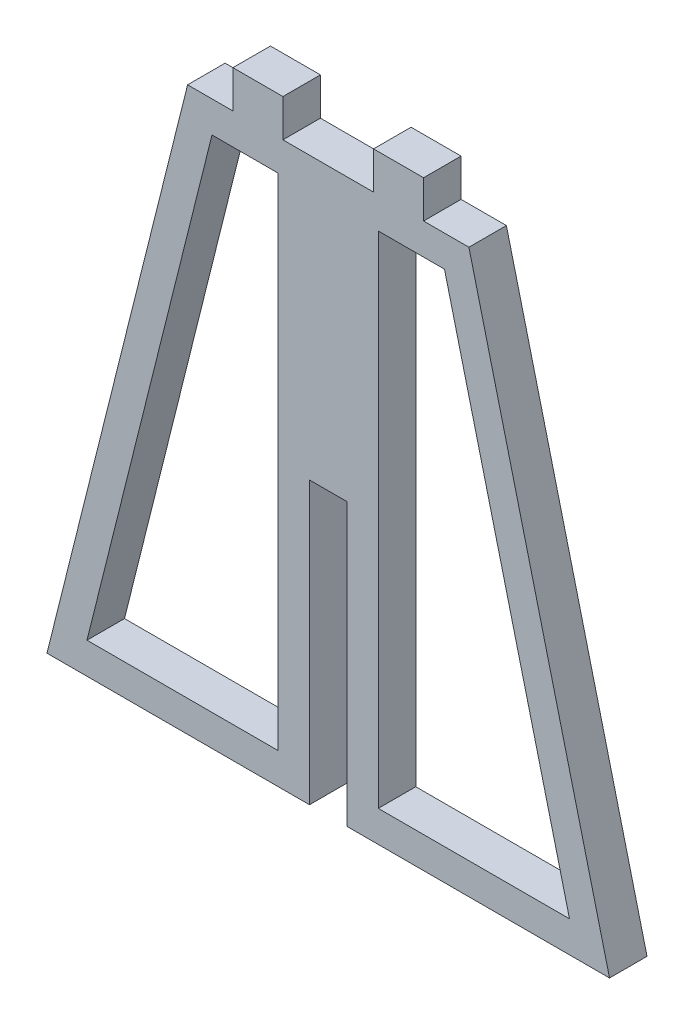
ISO-10303-21;
HEADER;
FILE_DESCRIPTION(('STEP AP214'),'2;1');
FILE_NAME('part.step','',(''),(''),'','','');
FILE_SCHEMA(('AUTOMOTIVE_DESIGN { 1 0 10303 214 1 1 1 1 }'));
ENDSEC;
DATA;
#1=APPLICATION_CONTEXT('core data for automotive mechanical design processes');
#2=APPLICATION_PROTOCOL_DEFINITION('international standard','automotive_design',2000,#1);
#3=PRODUCT_CONTEXT('',#1,'mechanical');
#4=PRODUCT('Part','Part','',(#3));
#5=PRODUCT_RELATED_PRODUCT_CATEGORY('part','',(#4));
#6=PRODUCT_DEFINITION_FORMATION('','',#4);
#7=PRODUCT_DEFINITION_CONTEXT('part definition',#1,'design');
#8=PRODUCT_DEFINITION('design','',#6,#7);
#9=PRODUCT_DEFINITION_SHAPE('','',#8);
#10=(LENGTH_UNIT() NAMED_UNIT(*) SI_UNIT(.MILLI.,.METRE.));
#11=(NAMED_UNIT(*) PLANE_ANGLE_UNIT() SI_UNIT($,.RADIAN.));
#12=(NAMED_UNIT(*) SI_UNIT($,.STERADIAN.) SOLID_ANGLE_UNIT());
#13=UNCERTAINTY_MEASURE_WITH_UNIT(LENGTH_MEASURE(1.E-05),#10,'distance_accuracy_value','');
#14=(GEOMETRIC_REPRESENTATION_CONTEXT(3) GLOBAL_UNCERTAINTY_ASSIGNED_CONTEXT((#13)) GLOBAL_UNIT_ASSIGNED_CONTEXT((#10,
#11,#12)) REPRESENTATION_CONTEXT('',''));
#15=CARTESIAN_POINT('',(0.,0.,0.));
#16=DIRECTION('',(0.,0.,1.));
#17=DIRECTION('',(1.,0.,0.));
#18=AXIS2_PLACEMENT_3D('',#15,#16,#17);
#19=CARTESIAN_POINT('',(0.,0.,6.));
#20=DIRECTION('',(0.,0.,-1.));
#21=DIRECTION('',(-1.,0.,0.));
#22=AXIS2_PLACEMENT_3D('',#19,#20,#21);
#23=PLANE('',#22);
#24=DIRECTION('',(0.,1.,0.));
#25=VECTOR('',#24,1.);
#26=CARTESIAN_POINT('',(-8.,14.8653846153846,6.));
#27=LINE('',#26,#25);
#28=CARTESIAN_POINT('',(-8.,14.8653846153846,6.));
#29=VERTEX_POINT('',#28);
#30=CARTESIAN_POINT('',(-8.,94.8653846153846,6.));
#31=VERTEX_POINT('',#30);
#32=EDGE_CURVE('E231',#29,#31,#27,.T.);
#33=ORIENTED_EDGE('',*,*,#32,.F.);
#34=DIRECTION('',(1.,0.,0.));
#35=VECTOR('',#34,1.);
#36=CARTESIAN_POINT('',(-38.5961179679779,14.8653846153846,6.));
#37=LINE('',#36,#35);
#38=CARTESIAN_POINT('',(-38.5961179679779,14.8653846153846,6.));
#39=VERTEX_POINT('',#38);
#40=EDGE_CURVE('E239',#39,#29,#37,.T.);
#41=ORIENTED_EDGE('',*,*,#40,.F.);
#42=DIRECTION('',(-0.242535625036333,-0.970142500145332,0.));
#43=VECTOR('',#42,1.);
#44=CARTESIAN_POINT('',(-18.5961179679779,94.8653846153846,6.));
#45=LINE('',#44,#43);
#46=CARTESIAN_POINT('',(-18.5961179679779,94.8653846153846,6.));
#47=VERTEX_POINT('',#46);
#48=EDGE_CURVE('E236',#47,#39,#45,.T.);
#49=ORIENTED_EDGE('',*,*,#48,.F.);
#50=DIRECTION('',(-1.,0.,0.));
#51=VECTOR('',#50,1.);
#52=CARTESIAN_POINT('',(-8.,94.8653846153846,6.));
#53=LINE('',#52,#51);
#54=EDGE_CURVE('E233',#31,#47,#53,.T.);
#55=ORIENTED_EDGE('',*,*,#54,.F.);
#56=EDGE_LOOP('',(#33,#41,#49,#55));
#57=FACE_BOUND('',#56,.T.);
#58=DIRECTION('',(-0.242535625036333,0.970142500145332,0.));
#59=VECTOR('',#58,1.);
#60=CARTESIAN_POINT('',(22.5,99.8653846153846,6.));
#61=LINE('',#60,#59);
#62=CARTESIAN_POINT('',(45.,9.86538461538461,6.));
#63=VERTEX_POINT('',#62);
#64=CARTESIAN_POINT('',(22.5,99.8653846153846,6.));
#65=VERTEX_POINT('',#64);
#66=EDGE_CURVE('E262',#63,#65,#61,.T.);
#67=ORIENTED_EDGE('',*,*,#66,.T.);
#68=DIRECTION('',(-1.,0.,0.));
#69=VECTOR('',#68,1.);
#70=CARTESIAN_POINT('',(15.25,99.8653846153846,6.));
#71=LINE('',#70,#69);
#72=CARTESIAN_POINT('',(15.25,99.8653846153846,6.));
#73=VERTEX_POINT('',#72);
#74=EDGE_CURVE('E265',#65,#73,#71,.T.);
#75=ORIENTED_EDGE('',*,*,#74,.T.);
#76=DIRECTION('',(0.,1.,0.));
#77=VECTOR('',#76,1.);
#78=CARTESIAN_POINT('',(15.25,99.8653846153846,6.));
#79=LINE('',#78,#77);
#80=CARTESIAN_POINT('',(15.25,105.865384615385,6.));
#81=VERTEX_POINT('',#80);
#82=EDGE_CURVE('E268',#73,#81,#79,.T.);
#83=ORIENTED_EDGE('',*,*,#82,.T.);
#84=DIRECTION('',(-1.,0.,0.));
#85=VECTOR('',#84,1.);
#86=CARTESIAN_POINT('',(7.25,105.865384615385,6.));
#87=LINE('',#86,#85);
#88=CARTESIAN_POINT('',(7.25,105.865384615385,6.));
#89=VERTEX_POINT('',#88);
#90=EDGE_CURVE('E270',#81,#89,#87,.T.);
#91=ORIENTED_EDGE('',*,*,#90,.T.);
#92=DIRECTION('',(0.,-1.,0.));
#93=VECTOR('',#92,1.);
#94=CARTESIAN_POINT('',(7.25,99.8653846153846,6.));
#95=LINE('',#94,#93);
#96=CARTESIAN_POINT('',(7.25,99.8653846153846,6.));
#97=VERTEX_POINT('',#96);
#98=EDGE_CURVE('E272',#89,#97,#95,.T.);
#99=ORIENTED_EDGE('',*,*,#98,.T.);
#100=DIRECTION('',(-1.,0.,0.));
#101=VECTOR('',#100,1.);
#102=CARTESIAN_POINT('',(-7.25,99.8653846153846,6.));
#103=LINE('',#102,#101);
#104=CARTESIAN_POINT('',(-7.25,99.8653846153846,6.));
#105=VERTEX_POINT('',#104);
#106=EDGE_CURVE('E274',#97,#105,#103,.T.);
#107=ORIENTED_EDGE('',*,*,#106,.T.);
#108=DIRECTION('',(0.,1.,0.));
#109=VECTOR('',#108,1.);
#110=CARTESIAN_POINT('',(-7.25,99.8653846153846,6.));
#111=LINE('',#110,#109);
#112=CARTESIAN_POINT('',(-7.25,105.865384615385,6.));
#113=VERTEX_POINT('',#112);
#114=EDGE_CURVE('E276',#105,#113,#111,.T.);
#115=ORIENTED_EDGE('',*,*,#114,.T.);
#116=DIRECTION('',(-1.,0.,0.));
#117=VECTOR('',#116,1.);
#118=CARTESIAN_POINT('',(-7.25,105.865384615385,6.));
#119=LINE('',#118,#117);
#120=CARTESIAN_POINT('',(-15.25,105.865384615385,6.));
#121=VERTEX_POINT('',#120);
#122=EDGE_CURVE('E278',#113,#121,#119,.T.);
#123=ORIENTED_EDGE('',*,*,#122,.T.);
#124=DIRECTION('',(0.,-1.,0.));
#125=VECTOR('',#124,1.);
#126=CARTESIAN_POINT('',(-15.25,99.8653846153846,6.));
#127=LINE('',#126,#125);
#128=CARTESIAN_POINT('',(-15.25,99.8653846153846,6.));
#129=VERTEX_POINT('',#128);
#130=EDGE_CURVE('E280',#121,#129,#127,.T.);
#131=ORIENTED_EDGE('',*,*,#130,.T.);
#132=DIRECTION('',(-1.,0.,0.));
#133=VECTOR('',#132,1.);
#134=CARTESIAN_POINT('',(-22.5,99.8653846153846,6.));
#135=LINE('',#134,#133);
#136=CARTESIAN_POINT('',(-22.5,99.8653846153846,6.));
#137=VERTEX_POINT('',#136);
#138=EDGE_CURVE('E282',#129,#137,#135,.T.);
#139=ORIENTED_EDGE('',*,*,#138,.T.);
#140=DIRECTION('',(-0.242535625036333,-0.970142500145332,0.));
#141=VECTOR('',#140,1.);
#142=CARTESIAN_POINT('',(-45.,9.8653846153846,6.));
#143=LINE('',#142,#141);
#144=CARTESIAN_POINT('',(-45.,9.8653846153846,6.));
#145=VERTEX_POINT('',#144);
#146=EDGE_CURVE('E284',#137,#145,#143,.T.);
#147=ORIENTED_EDGE('',*,*,#146,.T.);
#148=DIRECTION('',(1.,0.,0.));
#149=VECTOR('',#148,1.);
#150=CARTESIAN_POINT('',(-3.,9.86538461538459,6.));
#151=LINE('',#150,#149);
#152=CARTESIAN_POINT('',(-3.,9.86538461538459,6.));
#153=VERTEX_POINT('',#152);
#154=EDGE_CURVE('E286',#145,#153,#151,.T.);
#155=ORIENTED_EDGE('',*,*,#154,.T.);
#156=DIRECTION('',(0.,1.,0.));
#157=VECTOR('',#156,1.);
#158=CARTESIAN_POINT('',(-3.,54.8653846153846,6.));
#159=LINE('',#158,#157);
#160=CARTESIAN_POINT('',(-3.,54.8653846153846,6.));
#161=VERTEX_POINT('',#160);
#162=EDGE_CURVE('E288',#153,#161,#159,.T.);
#163=ORIENTED_EDGE('',*,*,#162,.T.);
#164=DIRECTION('',(1.,0.,0.));
#165=VECTOR('',#164,1.);
#166=CARTESIAN_POINT('',(3.,54.8653846153846,6.));
#167=LINE('',#166,#165);
#168=CARTESIAN_POINT('',(3.,54.8653846153846,6.));
#169=VERTEX_POINT('',#168);
#170=EDGE_CURVE('E290',#161,#169,#167,.T.);
#171=ORIENTED_EDGE('',*,*,#170,.T.);
#172=DIRECTION('',(0.,-1.,0.));
#173=VECTOR('',#172,1.);
#174=CARTESIAN_POINT('',(3.,54.8653846153846,6.));
#175=LINE('',#174,#173);
#176=CARTESIAN_POINT('',(3.,9.86538461538459,6.));
#177=VERTEX_POINT('',#176);
#178=EDGE_CURVE('E292',#169,#177,#175,.T.);
#179=ORIENTED_EDGE('',*,*,#178,.T.);
#180=DIRECTION('',(1.,0.,0.));
#181=VECTOR('',#180,1.);
#182=CARTESIAN_POINT('',(45.,9.86538461538461,6.));
#183=LINE('',#182,#181);
#184=EDGE_CURVE('E294',#177,#63,#183,.T.);
#185=ORIENTED_EDGE('',*,*,#184,.T.);
#186=EDGE_LOOP('',(#67,#75,#83,#91,#99,#107,#115,#123,#131,#139,#147,#155,#163,#171,#179,#185));
#187=FACE_BOUND('',#186,.T.);
#188=DIRECTION('',(-0.242535625036333,0.970142500145332,0.));
#189=VECTOR('',#188,1.);
#190=CARTESIAN_POINT('',(18.5961179679779,94.8653846153845,6.));
#191=LINE('',#190,#189);
#192=CARTESIAN_POINT('',(38.5961179679779,14.8653846153846,6.));
#193=VERTEX_POINT('',#192);
#194=CARTESIAN_POINT('',(18.5961179679779,94.8653846153845,6.));
#195=VERTEX_POINT('',#194);
#196=EDGE_CURVE('E195',#193,#195,#191,.T.);
#197=ORIENTED_EDGE('',*,*,#196,.F.);
#198=DIRECTION('',(1.,0.,0.));
#199=VECTOR('',#198,1.);
#200=CARTESIAN_POINT('',(38.5961179679779,14.8653846153846,6.));
#201=LINE('',#200,#199);
#202=CARTESIAN_POINT('',(8.,14.8653846153846,6.));
#203=VERTEX_POINT('',#202);
#204=EDGE_CURVE('E217',#203,#193,#201,.T.);
#205=ORIENTED_EDGE('',*,*,#204,.F.);
#206=DIRECTION('',(0.,-1.,0.));
#207=VECTOR('',#206,1.);
#208=CARTESIAN_POINT('',(8.,14.8653846153846,6.));
#209=LINE('',#208,#207);
#210=CARTESIAN_POINT('',(8.,94.8653846153845,6.));
#211=VERTEX_POINT('',#210);
#212=EDGE_CURVE('E215',#211,#203,#209,.T.);
#213=ORIENTED_EDGE('',*,*,#212,.F.);
#214=DIRECTION('',(-1.,0.,0.));
#215=VECTOR('',#214,1.);
#216=CARTESIAN_POINT('',(8.,94.8653846153845,6.));
#217=LINE('',#216,#215);
#218=EDGE_CURVE('E203',#195,#211,#217,.T.);
#219=ORIENTED_EDGE('',*,*,#218,.F.);
#220=EDGE_LOOP('',(#197,#205,#213,#219));
#221=FACE_BOUND('',#220,.T.);
#222=ADVANCED_FACE('F34',(#57,#187,#221),#23,.F.);
#223=CARTESIAN_POINT('',(0.,0.,0.));
#224=DIRECTION('',(0.,0.,-1.));
#225=DIRECTION('',(-1.,0.,0.));
#226=AXIS2_PLACEMENT_3D('',#223,#224,#225);
#227=PLANE('',#226);
#228=DIRECTION('',(-0.242535625036333,0.970142500145332,0.));
#229=VECTOR('',#228,1.);
#230=CARTESIAN_POINT('',(22.5,99.8653846153846,0.));
#231=LINE('',#230,#229);
#232=CARTESIAN_POINT('',(45.,9.86538461538461,0.));
#233=VERTEX_POINT('',#232);
#234=CARTESIAN_POINT('',(22.5,99.8653846153846,0.));
#235=VERTEX_POINT('',#234);
#236=EDGE_CURVE('E261',#233,#235,#231,.T.);
#237=ORIENTED_EDGE('',*,*,#236,.F.);
#238=DIRECTION('',(1.,0.,0.));
#239=VECTOR('',#238,1.);
#240=CARTESIAN_POINT('',(45.,9.86538461538461,0.));
#241=LINE('',#240,#239);
#242=CARTESIAN_POINT('',(3.,9.86538461538459,0.));
#243=VERTEX_POINT('',#242);
#244=EDGE_CURVE('E266',#243,#233,#241,.T.);
#245=ORIENTED_EDGE('',*,*,#244,.F.);
#246=DIRECTION('',(0.,-1.,0.));
#247=VECTOR('',#246,1.);
#248=CARTESIAN_POINT('',(3.,54.8653846153846,0.));
#249=LINE('',#248,#247);
#250=CARTESIAN_POINT('',(3.,54.8653846153846,0.));
#251=VERTEX_POINT('',#250);
#252=EDGE_CURVE('E325',#251,#243,#249,.T.);
#253=ORIENTED_EDGE('',*,*,#252,.F.);
#254=DIRECTION('',(1.,0.,0.));
#255=VECTOR('',#254,1.);
#256=CARTESIAN_POINT('',(3.,54.8653846153846,0.));
#257=LINE('',#256,#255);
#258=CARTESIAN_POINT('',(-3.,54.8653846153846,0.));
#259=VERTEX_POINT('',#258);
#260=EDGE_CURVE('E323',#259,#251,#257,.T.);
#261=ORIENTED_EDGE('',*,*,#260,.F.);
#262=DIRECTION('',(0.,1.,0.));
#263=VECTOR('',#262,1.);
#264=CARTESIAN_POINT('',(-3.,54.8653846153846,0.));
#265=LINE('',#264,#263);
#266=CARTESIAN_POINT('',(-3.,9.86538461538459,0.));
#267=VERTEX_POINT('',#266);
#268=EDGE_CURVE('E321',#267,#259,#265,.T.);
#269=ORIENTED_EDGE('',*,*,#268,.F.);
#270=DIRECTION('',(1.,0.,0.));
#271=VECTOR('',#270,1.);
#272=CARTESIAN_POINT('',(-3.,9.86538461538459,0.));
#273=LINE('',#272,#271);
#274=CARTESIAN_POINT('',(-45.,9.8653846153846,0.));
#275=VERTEX_POINT('',#274);
#276=EDGE_CURVE('E319',#275,#267,#273,.T.);
#277=ORIENTED_EDGE('',*,*,#276,.F.);
#278=DIRECTION('',(-0.242535625036333,-0.970142500145332,0.));
#279=VECTOR('',#278,1.);
#280=CARTESIAN_POINT('',(-45.,9.8653846153846,0.));
#281=LINE('',#280,#279);
#282=CARTESIAN_POINT('',(-22.5,99.8653846153846,0.));
#283=VERTEX_POINT('',#282);
#284=EDGE_CURVE('E317',#283,#275,#281,.T.);
#285=ORIENTED_EDGE('',*,*,#284,.F.);
#286=DIRECTION('',(-1.,0.,0.));
#287=VECTOR('',#286,1.);
#288=CARTESIAN_POINT('',(-22.5,99.8653846153846,0.));
#289=LINE('',#288,#287);
#290=CARTESIAN_POINT('',(-15.25,99.8653846153846,0.));
#291=VERTEX_POINT('',#290);
#292=EDGE_CURVE('E315',#291,#283,#289,.T.);
#293=ORIENTED_EDGE('',*,*,#292,.F.);
#294=DIRECTION('',(0.,-1.,0.));
#295=VECTOR('',#294,1.);
#296=CARTESIAN_POINT('',(-15.25,99.8653846153846,0.));
#297=LINE('',#296,#295);
#298=CARTESIAN_POINT('',(-15.25,105.865384615385,0.));
#299=VERTEX_POINT('',#298);
#300=EDGE_CURVE('E313',#299,#291,#297,.T.);
#301=ORIENTED_EDGE('',*,*,#300,.F.);
#302=DIRECTION('',(-1.,0.,0.));
#303=VECTOR('',#302,1.);
#304=CARTESIAN_POINT('',(-7.25,105.865384615385,0.));
#305=LINE('',#304,#303);
#306=CARTESIAN_POINT('',(-7.25,105.865384615385,0.));
#307=VERTEX_POINT('',#306);
#308=EDGE_CURVE('E311',#307,#299,#305,.T.);
#309=ORIENTED_EDGE('',*,*,#308,.F.);
#310=DIRECTION('',(0.,1.,0.));
#311=VECTOR('',#310,1.);
#312=CARTESIAN_POINT('',(-7.25,99.8653846153846,0.));
#313=LINE('',#312,#311);
#314=CARTESIAN_POINT('',(-7.25,99.8653846153846,0.));
#315=VERTEX_POINT('',#314);
#316=EDGE_CURVE('E309',#315,#307,#313,.T.);
#317=ORIENTED_EDGE('',*,*,#316,.F.);
#318=DIRECTION('',(-1.,0.,0.));
#319=VECTOR('',#318,1.);
#320=CARTESIAN_POINT('',(-7.25,99.8653846153846,0.));
#321=LINE('',#320,#319);
#322=CARTESIAN_POINT('',(7.25,99.8653846153846,0.));
#323=VERTEX_POINT('',#322);
#324=EDGE_CURVE('E307',#323,#315,#321,.T.);
#325=ORIENTED_EDGE('',*,*,#324,.F.);
#326=DIRECTION('',(0.,-1.,0.));
#327=VECTOR('',#326,1.);
#328=CARTESIAN_POINT('',(7.25,99.8653846153846,0.));
#329=LINE('',#328,#327);
#330=CARTESIAN_POINT('',(7.25,105.865384615385,0.));
#331=VERTEX_POINT('',#330);
#332=EDGE_CURVE('E305',#331,#323,#329,.T.);
#333=ORIENTED_EDGE('',*,*,#332,.F.);
#334=DIRECTION('',(-1.,0.,0.));
#335=VECTOR('',#334,1.);
#336=CARTESIAN_POINT('',(7.25,105.865384615385,0.));
#337=LINE('',#336,#335);
#338=CARTESIAN_POINT('',(15.25,105.865384615385,0.));
#339=VERTEX_POINT('',#338);
#340=EDGE_CURVE('E303',#339,#331,#337,.T.);
#341=ORIENTED_EDGE('',*,*,#340,.F.);
#342=DIRECTION('',(0.,1.,0.));
#343=VECTOR('',#342,1.);
#344=CARTESIAN_POINT('',(15.25,99.8653846153846,0.));
#345=LINE('',#344,#343);
#346=CARTESIAN_POINT('',(15.25,99.8653846153846,0.));
#347=VERTEX_POINT('',#346);
#348=EDGE_CURVE('E301',#347,#339,#345,.T.);
#349=ORIENTED_EDGE('',*,*,#348,.F.);
#350=DIRECTION('',(-1.,0.,0.));
#351=VECTOR('',#350,1.);
#352=CARTESIAN_POINT('',(15.25,99.8653846153846,0.));
#353=LINE('',#352,#351);
#354=EDGE_CURVE('E299',#235,#347,#353,.T.);
#355=ORIENTED_EDGE('',*,*,#354,.F.);
#356=EDGE_LOOP('',(#237,#245,#253,#261,#269,#277,#285,#293,#301,#309,#317,#325,#333,#341,#349,#355));
#357=FACE_BOUND('',#356,.T.);
#358=DIRECTION('',(1.,0.,0.));
#359=VECTOR('',#358,1.);
#360=CARTESIAN_POINT('',(-38.5961179679779,14.8653846153846,0.));
#361=LINE('',#360,#359);
#362=CARTESIAN_POINT('',(-38.5961179679779,14.8653846153846,0.));
#363=VERTEX_POINT('',#362);
#364=CARTESIAN_POINT('',(-8.,14.8653846153846,0.));
#365=VERTEX_POINT('',#364);
#366=EDGE_CURVE('E234',#363,#365,#361,.T.);
#367=ORIENTED_EDGE('',*,*,#366,.T.);
#368=DIRECTION('',(0.,1.,0.));
#369=VECTOR('',#368,1.);
#370=CARTESIAN_POINT('',(-8.,14.8653846153846,0.));
#371=LINE('',#370,#369);
#372=CARTESIAN_POINT('',(-8.,94.8653846153846,0.));
#373=VERTEX_POINT('',#372);
#374=EDGE_CURVE('E211',#365,#373,#371,.T.);
#375=ORIENTED_EDGE('',*,*,#374,.T.);
#376=DIRECTION('',(-1.,0.,0.));
#377=VECTOR('',#376,1.);
#378=CARTESIAN_POINT('',(-8.,94.8653846153846,0.));
#379=LINE('',#378,#377);
#380=CARTESIAN_POINT('',(-18.5961179679779,94.8653846153846,0.));
#381=VERTEX_POINT('',#380);
#382=EDGE_CURVE('E244',#373,#381,#379,.T.);
#383=ORIENTED_EDGE('',*,*,#382,.T.);
#384=DIRECTION('',(-0.242535625036333,-0.970142500145332,0.));
#385=VECTOR('',#384,1.);
#386=CARTESIAN_POINT('',(-18.5961179679779,94.8653846153846,0.));
#387=LINE('',#386,#385);
#388=EDGE_CURVE('E247',#381,#363,#387,.T.);
#389=ORIENTED_EDGE('',*,*,#388,.T.);
#390=EDGE_LOOP('',(#367,#375,#383,#389));
#391=FACE_BOUND('',#390,.T.);
#392=DIRECTION('',(1.,0.,0.));
#393=VECTOR('',#392,1.);
#394=CARTESIAN_POINT('',(38.5961179679779,14.8653846153846,0.));
#395=LINE('',#394,#393);
#396=CARTESIAN_POINT('',(8.,14.8653846153846,0.));
#397=VERTEX_POINT('',#396);
#398=CARTESIAN_POINT('',(38.5961179679779,14.8653846153846,0.));
#399=VERTEX_POINT('',#398);
#400=EDGE_CURVE('E204',#397,#399,#395,.T.);
#401=ORIENTED_EDGE('',*,*,#400,.T.);
#402=DIRECTION('',(-0.242535625036333,0.970142500145332,0.));
#403=VECTOR('',#402,1.);
#404=CARTESIAN_POINT('',(18.5961179679779,94.8653846153845,0.));
#405=LINE('',#404,#403);
#406=CARTESIAN_POINT('',(18.5961179679779,94.8653846153845,0.));
#407=VERTEX_POINT('',#406);
#408=EDGE_CURVE('E57',#399,#407,#405,.T.);
#409=ORIENTED_EDGE('',*,*,#408,.T.);
#410=DIRECTION('',(-1.,0.,0.));
#411=VECTOR('',#410,1.);
#412=CARTESIAN_POINT('',(8.,94.8653846153845,0.));
#413=LINE('',#412,#411);
#414=CARTESIAN_POINT('',(8.,94.8653846153845,0.));
#415=VERTEX_POINT('',#414);
#416=EDGE_CURVE('E210',#407,#415,#413,.T.);
#417=ORIENTED_EDGE('',*,*,#416,.T.);
#418=DIRECTION('',(0.,-1.,0.));
#419=VECTOR('',#418,1.);
#420=CARTESIAN_POINT('',(8.,14.8653846153846,0.));
#421=LINE('',#420,#419);
#422=EDGE_CURVE('E223',#415,#397,#421,.T.);
#423=ORIENTED_EDGE('',*,*,#422,.T.);
#424=EDGE_LOOP('',(#401,#409,#417,#423));
#425=FACE_BOUND('',#424,.T.);
#426=ADVANCED_FACE('F379',(#357,#391,#425),#227,.T.);
#427=CARTESIAN_POINT('',(22.5,99.8653846153846,6.));
#428=DIRECTION('',(-0.970142500145332,-0.242535625036333,0.));
#429=DIRECTION('',(0.242535625036333,-0.970142500145332,0.));
#430=AXIS2_PLACEMENT_3D('',#427,#428,#429);
#431=PLANE('',#430);
#432=ORIENTED_EDGE('',*,*,#236,.T.);
#433=DIRECTION('',(0.,0.,-1.));
#434=VECTOR('',#433,1.);
#435=CARTESIAN_POINT('',(22.5,99.8653846153846,6.));
#436=LINE('',#435,#434);
#437=EDGE_CURVE('E11',#65,#235,#436,.T.);
#438=ORIENTED_EDGE('',*,*,#437,.F.);
#439=ORIENTED_EDGE('',*,*,#66,.F.);
#440=DIRECTION('',(0.,0.,-1.));
#441=VECTOR('',#440,1.);
#442=CARTESIAN_POINT('',(45.,9.86538461538461,6.));
#443=LINE('',#442,#441);
#444=EDGE_CURVE('E296',#63,#233,#443,.T.);
#445=ORIENTED_EDGE('',*,*,#444,.T.);
#446=EDGE_LOOP('',(#432,#438,#439,#445));
#447=FACE_BOUND('',#446,.T.);
#448=ADVANCED_FACE('F36',(#447),#431,.F.);
#449=CARTESIAN_POINT('',(15.25,99.8653846153846,6.));
#450=DIRECTION('',(0.,-1.,0.));
#451=DIRECTION('',(0.,0.,-1.));
#452=AXIS2_PLACEMENT_3D('',#449,#450,#451);
#453=PLANE('',#452);
#454=ORIENTED_EDGE('',*,*,#354,.T.);
#455=DIRECTION('',(0.,0.,-1.));
#456=VECTOR('',#455,1.);
#457=CARTESIAN_POINT('',(15.25,99.8653846153846,6.));
#458=LINE('',#457,#456);
#459=EDGE_CURVE('E42',#73,#347,#458,.T.);
#460=ORIENTED_EDGE('',*,*,#459,.F.);
#461=ORIENTED_EDGE('',*,*,#74,.F.);
#462=ORIENTED_EDGE('',*,*,#437,.T.);
#463=EDGE_LOOP('',(#454,#460,#461,#462));
#464=FACE_BOUND('',#463,.T.);
#465=ADVANCED_FACE('F396',(#464),#453,.F.);
#466=CARTESIAN_POINT('',(15.25,99.8653846153846,6.));
#467=DIRECTION('',(-1.,0.,0.));
#468=DIRECTION('',(0.,-1.,0.));
#469=AXIS2_PLACEMENT_3D('',#466,#467,#468);
#470=PLANE('',#469);
#471=ORIENTED_EDGE('',*,*,#348,.T.);
#472=DIRECTION('',(0.,0.,-1.));
#473=VECTOR('',#472,1.);
#474=CARTESIAN_POINT('',(15.25,105.865384615385,6.));
#475=LINE('',#474,#473);
#476=EDGE_CURVE('E366',#81,#339,#475,.T.);
#477=ORIENTED_EDGE('',*,*,#476,.F.);
#478=ORIENTED_EDGE('',*,*,#82,.F.);
#479=ORIENTED_EDGE('',*,*,#459,.T.);
#480=EDGE_LOOP('',(#471,#477,#478,#479));
#481=FACE_BOUND('',#480,.T.);
#482=ADVANCED_FACE('F373',(#481),#470,.F.);
#483=CARTESIAN_POINT('',(7.25,105.865384615385,6.));
#484=DIRECTION('',(0.,-1.,0.));
#485=DIRECTION('',(0.,0.,-1.));
#486=AXIS2_PLACEMENT_3D('',#483,#484,#485);
#487=PLANE('',#486);
#488=ORIENTED_EDGE('',*,*,#340,.T.);
#489=DIRECTION('',(0.,0.,-1.));
#490=VECTOR('',#489,1.);
#491=CARTESIAN_POINT('',(7.25,105.865384615385,6.));
#492=LINE('',#491,#490);
#493=EDGE_CURVE('E363',#89,#331,#492,.T.);
#494=ORIENTED_EDGE('',*,*,#493,.F.);
#495=ORIENTED_EDGE('',*,*,#90,.F.);
#496=ORIENTED_EDGE('',*,*,#476,.T.);
#497=EDGE_LOOP('',(#488,#494,#495,#496));
#498=FACE_BOUND('',#497,.T.);
#499=ADVANCED_FACE('F385',(#498),#487,.F.);
#500=CARTESIAN_POINT('',(7.25,99.8653846153846,6.));
#501=DIRECTION('',(1.,0.,0.));
#502=DIRECTION('',(0.,1.,0.));
#503=AXIS2_PLACEMENT_3D('',#500,#501,#502);
#504=PLANE('',#503);
#505=ORIENTED_EDGE('',*,*,#332,.T.);
#506=DIRECTION('',(0.,0.,-1.));
#507=VECTOR('',#506,1.);
#508=CARTESIAN_POINT('',(7.25,99.8653846153846,6.));
#509=LINE('',#508,#507);
#510=EDGE_CURVE('E360',#97,#323,#509,.T.);
#511=ORIENTED_EDGE('',*,*,#510,.F.);
#512=ORIENTED_EDGE('',*,*,#98,.F.);
#513=ORIENTED_EDGE('',*,*,#493,.T.);
#514=EDGE_LOOP('',(#505,#511,#512,#513));
#515=FACE_BOUND('',#514,.T.);
#516=ADVANCED_FACE('F389',(#515),#504,.F.);
#517=CARTESIAN_POINT('',(-7.25,99.8653846153846,6.));
#518=DIRECTION('',(0.,-1.,0.));
#519=DIRECTION('',(0.,0.,-1.));
#520=AXIS2_PLACEMENT_3D('',#517,#518,#519);
#521=PLANE('',#520);
#522=ORIENTED_EDGE('',*,*,#324,.T.);
#523=DIRECTION('',(0.,0.,-1.));
#524=VECTOR('',#523,1.);
#525=CARTESIAN_POINT('',(-7.25,99.8653846153846,6.));
#526=LINE('',#525,#524);
#527=EDGE_CURVE('E357',#105,#315,#526,.T.);
#528=ORIENTED_EDGE('',*,*,#527,.F.);
#529=ORIENTED_EDGE('',*,*,#106,.F.);
#530=ORIENTED_EDGE('',*,*,#510,.T.);
#531=EDGE_LOOP('',(#522,#528,#529,#530));
#532=FACE_BOUND('',#531,.T.);
#533=ADVANCED_FACE('F449',(#532),#521,.F.);
#534=CARTESIAN_POINT('',(-7.25,99.8653846153846,6.));
#535=DIRECTION('',(-1.,0.,0.));
#536=DIRECTION('',(0.,-1.,0.));
#537=AXIS2_PLACEMENT_3D('',#534,#535,#536);
#538=PLANE('',#537);
#539=ORIENTED_EDGE('',*,*,#316,.T.);
#540=DIRECTION('',(0.,0.,-1.));
#541=VECTOR('',#540,1.);
#542=CARTESIAN_POINT('',(-7.25,105.865384615385,6.));
#543=LINE('',#542,#541);
#544=EDGE_CURVE('E354',#113,#307,#543,.T.);
#545=ORIENTED_EDGE('',*,*,#544,.F.);
#546=ORIENTED_EDGE('',*,*,#114,.F.);
#547=ORIENTED_EDGE('',*,*,#527,.T.);
#548=EDGE_LOOP('',(#539,#545,#546,#547));
#549=FACE_BOUND('',#548,.T.);
#550=ADVANCED_FACE('F446',(#549),#538,.F.);
#551=CARTESIAN_POINT('',(-7.25,105.865384615385,6.));
#552=DIRECTION('',(0.,-1.,0.));
#553=DIRECTION('',(0.,0.,-1.));
#554=AXIS2_PLACEMENT_3D('',#551,#552,#553);
#555=PLANE('',#554);
#556=ORIENTED_EDGE('',*,*,#308,.T.);
#557=DIRECTION('',(0.,0.,-1.));
#558=VECTOR('',#557,1.);
#559=CARTESIAN_POINT('',(-15.25,105.865384615385,6.));
#560=LINE('',#559,#558);
#561=EDGE_CURVE('E351',#121,#299,#560,.T.);
#562=ORIENTED_EDGE('',*,*,#561,.F.);
#563=ORIENTED_EDGE('',*,*,#122,.F.);
#564=ORIENTED_EDGE('',*,*,#544,.T.);
#565=EDGE_LOOP('',(#556,#562,#563,#564));
#566=FACE_BOUND('',#565,.T.);
#567=ADVANCED_FACE('F442',(#566),#555,.F.);
#568=CARTESIAN_POINT('',(-15.25,99.8653846153846,6.));
#569=DIRECTION('',(1.,0.,0.));
#570=DIRECTION('',(0.,1.,0.));
#571=AXIS2_PLACEMENT_3D('',#568,#569,#570);
#572=PLANE('',#571);
#573=ORIENTED_EDGE('',*,*,#300,.T.);
#574=DIRECTION('',(0.,0.,-1.));
#575=VECTOR('',#574,1.);
#576=CARTESIAN_POINT('',(-15.25,99.8653846153846,6.));
#577=LINE('',#576,#575);
#578=EDGE_CURVE('E348',#129,#291,#577,.T.);
#579=ORIENTED_EDGE('',*,*,#578,.F.);
#580=ORIENTED_EDGE('',*,*,#130,.F.);
#581=ORIENTED_EDGE('',*,*,#561,.T.);
#582=EDGE_LOOP('',(#573,#579,#580,#581));
#583=FACE_BOUND('',#582,.T.);
#584=ADVANCED_FACE('F438',(#583),#572,.F.);
#585=CARTESIAN_POINT('',(-22.5,99.8653846153846,6.));
#586=DIRECTION('',(0.,-1.,0.));
#587=DIRECTION('',(0.,0.,-1.));
#588=AXIS2_PLACEMENT_3D('',#585,#586,#587);
#589=PLANE('',#588);
#590=ORIENTED_EDGE('',*,*,#292,.T.);
#591=DIRECTION('',(0.,0.,-1.));
#592=VECTOR('',#591,1.);
#593=CARTESIAN_POINT('',(-22.5,99.8653846153846,6.));
#594=LINE('',#593,#592);
#595=EDGE_CURVE('E345',#137,#283,#594,.T.);
#596=ORIENTED_EDGE('',*,*,#595,.F.);
#597=ORIENTED_EDGE('',*,*,#138,.F.);
#598=ORIENTED_EDGE('',*,*,#578,.T.);
#599=EDGE_LOOP('',(#590,#596,#597,#598));
#600=FACE_BOUND('',#599,.T.);
#601=ADVANCED_FACE('F433',(#600),#589,.F.);
#602=CARTESIAN_POINT('',(-45.,9.8653846153846,6.));
#603=DIRECTION('',(0.970142500145332,-0.242535625036333,0.));
#604=DIRECTION('',(0.242535625036333,0.970142500145332,0.));
#605=AXIS2_PLACEMENT_3D('',#602,#603,#604);
#606=PLANE('',#605);
#607=ORIENTED_EDGE('',*,*,#284,.T.);
#608=DIRECTION('',(0.,0.,-1.));
#609=VECTOR('',#608,1.);
#610=CARTESIAN_POINT('',(-45.,9.8653846153846,6.));
#611=LINE('',#610,#609);
#612=EDGE_CURVE('E342',#145,#275,#611,.T.);
#613=ORIENTED_EDGE('',*,*,#612,.F.);
#614=ORIENTED_EDGE('',*,*,#146,.F.);
#615=ORIENTED_EDGE('',*,*,#595,.T.);
#616=EDGE_LOOP('',(#607,#613,#614,#615));
#617=FACE_BOUND('',#616,.T.);
#618=ADVANCED_FACE('F427',(#617),#606,.F.);
#619=CARTESIAN_POINT('',(-3.,9.86538461538459,6.));
#620=DIRECTION('',(0.,1.,0.));
#621=DIRECTION('',(-1.,0.,0.));
#622=AXIS2_PLACEMENT_3D('',#619,#620,#621);
#623=PLANE('',#622);
#624=ORIENTED_EDGE('',*,*,#276,.T.);
#625=DIRECTION('',(0.,0.,-1.));
#626=VECTOR('',#625,1.);
#627=CARTESIAN_POINT('',(-3.,9.86538461538459,6.));
#628=LINE('',#627,#626);
#629=EDGE_CURVE('E339',#153,#267,#628,.T.);
#630=ORIENTED_EDGE('',*,*,#629,.F.);
#631=ORIENTED_EDGE('',*,*,#154,.F.);
#632=ORIENTED_EDGE('',*,*,#612,.T.);
#633=EDGE_LOOP('',(#624,#630,#631,#632));
#634=FACE_BOUND('',#633,.T.);
#635=ADVANCED_FACE('F423',(#634),#623,.F.);
#636=CARTESIAN_POINT('',(-3.,54.8653846153846,6.));
#637=DIRECTION('',(-1.,0.,0.));
#638=DIRECTION('',(0.,0.,1.));
#639=AXIS2_PLACEMENT_3D('',#636,#637,#638);
#640=PLANE('',#639);
#641=ORIENTED_EDGE('',*,*,#268,.T.);
#642=DIRECTION('',(0.,0.,-1.));
#643=VECTOR('',#642,1.);
#644=CARTESIAN_POINT('',(-3.,54.8653846153846,6.));
#645=LINE('',#644,#643);
#646=EDGE_CURVE('E336',#161,#259,#645,.T.);
#647=ORIENTED_EDGE('',*,*,#646,.F.);
#648=ORIENTED_EDGE('',*,*,#162,.F.);
#649=ORIENTED_EDGE('',*,*,#629,.T.);
#650=EDGE_LOOP('',(#641,#647,#648,#649));
#651=FACE_BOUND('',#650,.T.);
#652=ADVANCED_FACE('F418',(#651),#640,.F.);
#653=CARTESIAN_POINT('',(3.,54.8653846153846,6.));
#654=DIRECTION('',(0.,1.,0.));
#655=DIRECTION('',(0.,0.,1.));
#656=AXIS2_PLACEMENT_3D('',#653,#654,#655);
#657=PLANE('',#656);
#658=ORIENTED_EDGE('',*,*,#260,.T.);
#659=DIRECTION('',(0.,0.,-1.));
#660=VECTOR('',#659,1.);
#661=CARTESIAN_POINT('',(3.,54.8653846153846,6.));
#662=LINE('',#661,#660);
#663=EDGE_CURVE('E333',#169,#251,#662,.T.);
#664=ORIENTED_EDGE('',*,*,#663,.F.);
#665=ORIENTED_EDGE('',*,*,#170,.F.);
#666=ORIENTED_EDGE('',*,*,#646,.T.);
#667=EDGE_LOOP('',(#658,#664,#665,#666));
#668=FACE_BOUND('',#667,.T.);
#669=ADVANCED_FACE('F412',(#668),#657,.F.);
#670=CARTESIAN_POINT('',(3.,54.8653846153846,6.));
#671=DIRECTION('',(1.,0.,0.));
#672=DIRECTION('',(0.,0.,-1.));
#673=AXIS2_PLACEMENT_3D('',#670,#671,#672);
#674=PLANE('',#673);
#675=ORIENTED_EDGE('',*,*,#252,.T.);
#676=DIRECTION('',(0.,0.,-1.));
#677=VECTOR('',#676,1.);
#678=CARTESIAN_POINT('',(3.,9.86538461538459,6.));
#679=LINE('',#678,#677);
#680=EDGE_CURVE('E330',#177,#243,#679,.T.);
#681=ORIENTED_EDGE('',*,*,#680,.F.);
#682=ORIENTED_EDGE('',*,*,#178,.F.);
#683=ORIENTED_EDGE('',*,*,#663,.T.);
#684=EDGE_LOOP('',(#675,#681,#682,#683));
#685=FACE_BOUND('',#684,.T.);
#686=ADVANCED_FACE('F408',(#685),#674,.F.);
#687=CARTESIAN_POINT('',(45.,9.86538461538461,6.));
#688=DIRECTION('',(0.,1.,0.));
#689=DIRECTION('',(-1.,0.,0.));
#690=AXIS2_PLACEMENT_3D('',#687,#688,#689);
#691=PLANE('',#690);
#692=ORIENTED_EDGE('',*,*,#244,.T.);
#693=ORIENTED_EDGE('',*,*,#444,.F.);
#694=ORIENTED_EDGE('',*,*,#184,.F.);
#695=ORIENTED_EDGE('',*,*,#680,.T.);
#696=EDGE_LOOP('',(#692,#693,#694,#695));
#697=FACE_BOUND('',#696,.T.);
#698=ADVANCED_FACE('F403',(#697),#691,.F.);
#699=CARTESIAN_POINT('',(-8.,14.8653846153846,6.));
#700=DIRECTION('',(-1.,0.,0.));
#701=DIRECTION('',(0.,0.,1.));
#702=AXIS2_PLACEMENT_3D('',#699,#700,#701);
#703=PLANE('',#702);
#704=ORIENTED_EDGE('',*,*,#374,.F.);
#705=DIRECTION('',(0.,0.,-1.));
#706=VECTOR('',#705,1.);
#707=CARTESIAN_POINT('',(-8.,14.8653846153846,6.));
#708=LINE('',#707,#706);
#709=EDGE_CURVE('E241',#29,#365,#708,.T.);
#710=ORIENTED_EDGE('',*,*,#709,.F.);
#711=ORIENTED_EDGE('',*,*,#32,.T.);
#712=DIRECTION('',(0.,0.,-1.));
#713=VECTOR('',#712,1.);
#714=CARTESIAN_POINT('',(-8.,94.8653846153846,6.));
#715=LINE('',#714,#713);
#716=EDGE_CURVE('E258',#31,#373,#715,.T.);
#717=ORIENTED_EDGE('',*,*,#716,.T.);
#718=EDGE_LOOP('',(#704,#710,#711,#717));
#719=FACE_BOUND('',#718,.T.);
#720=ADVANCED_FACE('F467',(#719),#703,.T.);
#721=CARTESIAN_POINT('',(-8.,94.8653846153846,6.));
#722=DIRECTION('',(0.,-1.,0.));
#723=DIRECTION('',(0.,0.,-1.));
#724=AXIS2_PLACEMENT_3D('',#721,#722,#723);
#725=PLANE('',#724);
#726=ORIENTED_EDGE('',*,*,#382,.F.);
#727=ORIENTED_EDGE('',*,*,#716,.F.);
#728=ORIENTED_EDGE('',*,*,#54,.T.);
#729=DIRECTION('',(0.,0.,-1.));
#730=VECTOR('',#729,1.);
#731=CARTESIAN_POINT('',(-18.5961179679779,94.8653846153846,6.));
#732=LINE('',#731,#730);
#733=EDGE_CURVE('E256',#47,#381,#732,.T.);
#734=ORIENTED_EDGE('',*,*,#733,.T.);
#735=EDGE_LOOP('',(#726,#727,#728,#734));
#736=FACE_BOUND('',#735,.T.);
#737=ADVANCED_FACE('F529',(#736),#725,.T.);
#738=CARTESIAN_POINT('',(-18.5961179679779,94.8653846153846,6.));
#739=DIRECTION('',(0.970142500145332,-0.242535625036333,0.));
#740=DIRECTION('',(0.242535625036333,0.970142500145332,0.));
#741=AXIS2_PLACEMENT_3D('',#738,#739,#740);
#742=PLANE('',#741);
#743=ORIENTED_EDGE('',*,*,#388,.F.);
#744=ORIENTED_EDGE('',*,*,#733,.F.);
#745=ORIENTED_EDGE('',*,*,#48,.T.);
#746=DIRECTION('',(0.,0.,-1.));
#747=VECTOR('',#746,1.);
#748=CARTESIAN_POINT('',(-38.5961179679779,14.8653846153846,6.));
#749=LINE('',#748,#747);
#750=EDGE_CURVE('E254',#39,#363,#749,.T.);
#751=ORIENTED_EDGE('',*,*,#750,.T.);
#752=EDGE_LOOP('',(#743,#744,#745,#751));
#753=FACE_BOUND('',#752,.T.);
#754=ADVANCED_FACE('F536',(#753),#742,.T.);
#755=CARTESIAN_POINT('',(-38.5961179679779,14.8653846153846,6.));
#756=DIRECTION('',(0.,1.,0.));
#757=DIRECTION('',(0.,0.,1.));
#758=AXIS2_PLACEMENT_3D('',#755,#756,#757);
#759=PLANE('',#758);
#760=ORIENTED_EDGE('',*,*,#366,.F.);
#761=ORIENTED_EDGE('',*,*,#750,.F.);
#762=ORIENTED_EDGE('',*,*,#40,.T.);
#763=ORIENTED_EDGE('',*,*,#709,.T.);
#764=EDGE_LOOP('',(#760,#761,#762,#763));
#765=FACE_BOUND('',#764,.T.);
#766=ADVANCED_FACE('F543',(#765),#759,.T.);
#767=CARTESIAN_POINT('',(18.5961179679779,94.8653846153845,6.));
#768=DIRECTION('',(-0.970142500145332,-0.242535625036333,0.));
#769=DIRECTION('',(0.242535625036333,-0.970142500145332,0.));
#770=AXIS2_PLACEMENT_3D('',#767,#768,#769);
#771=PLANE('',#770);
#772=ORIENTED_EDGE('',*,*,#408,.F.);
#773=DIRECTION('',(0.,0.,-1.));
#774=VECTOR('',#773,1.);
#775=CARTESIAN_POINT('',(38.5961179679779,14.8653846153846,6.));
#776=LINE('',#775,#774);
#777=EDGE_CURVE('E199',#193,#399,#776,.T.);
#778=ORIENTED_EDGE('',*,*,#777,.F.);
#779=ORIENTED_EDGE('',*,*,#196,.T.);
#780=DIRECTION('',(0.,0.,-1.));
#781=VECTOR('',#780,1.);
#782=CARTESIAN_POINT('',(18.5961179679779,94.8653846153845,6.));
#783=LINE('',#782,#781);
#784=EDGE_CURVE('E198',#195,#407,#783,.T.);
#785=ORIENTED_EDGE('',*,*,#784,.T.);
#786=EDGE_LOOP('',(#772,#778,#779,#785));
#787=FACE_BOUND('',#786,.T.);
#788=ADVANCED_FACE('F197',(#787),#771,.T.);
#789=CARTESIAN_POINT('',(8.,94.8653846153845,6.));
#790=DIRECTION('',(0.,-1.,0.));
#791=DIRECTION('',(0.,0.,-1.));
#792=AXIS2_PLACEMENT_3D('',#789,#790,#791);
#793=PLANE('',#792);
#794=ORIENTED_EDGE('',*,*,#416,.F.);
#795=ORIENTED_EDGE('',*,*,#784,.F.);
#796=ORIENTED_EDGE('',*,*,#218,.T.);
#797=DIRECTION('',(0.,0.,-1.));
#798=VECTOR('',#797,1.);
#799=CARTESIAN_POINT('',(8.,94.8653846153845,6.));
#800=LINE('',#799,#798);
#801=EDGE_CURVE('E212',#211,#415,#800,.T.);
#802=ORIENTED_EDGE('',*,*,#801,.T.);
#803=EDGE_LOOP('',(#794,#795,#796,#802));
#804=FACE_BOUND('',#803,.T.);
#805=ADVANCED_FACE('F207',(#804),#793,.T.);
#806=CARTESIAN_POINT('',(8.,14.8653846153846,6.));
#807=DIRECTION('',(1.,0.,0.));
#808=DIRECTION('',(0.,0.,-1.));
#809=AXIS2_PLACEMENT_3D('',#806,#807,#808);
#810=PLANE('',#809);
#811=ORIENTED_EDGE('',*,*,#422,.F.);
#812=ORIENTED_EDGE('',*,*,#801,.F.);
#813=ORIENTED_EDGE('',*,*,#212,.T.);
#814=DIRECTION('',(0.,0.,-1.));
#815=VECTOR('',#814,1.);
#816=CARTESIAN_POINT('',(8.,14.8653846153846,6.));
#817=LINE('',#816,#815);
#818=EDGE_CURVE('E49',#203,#397,#817,.T.);
#819=ORIENTED_EDGE('',*,*,#818,.T.);
#820=EDGE_LOOP('',(#811,#812,#813,#819));
#821=FACE_BOUND('',#820,.T.);
#822=ADVANCED_FACE('F564',(#821),#810,.T.);
#823=CARTESIAN_POINT('',(38.5961179679779,14.8653846153846,6.));
#824=DIRECTION('',(0.,1.,0.));
#825=DIRECTION('',(0.,0.,1.));
#826=AXIS2_PLACEMENT_3D('',#823,#824,#825);
#827=PLANE('',#826);
#828=ORIENTED_EDGE('',*,*,#400,.F.);
#829=ORIENTED_EDGE('',*,*,#818,.F.);
#830=ORIENTED_EDGE('',*,*,#204,.T.);
#831=ORIENTED_EDGE('',*,*,#777,.T.);
#832=EDGE_LOOP('',(#828,#829,#830,#831));
#833=FACE_BOUND('',#832,.T.);
#834=ADVANCED_FACE('F571',(#833),#827,.T.);
#835=CLOSED_SHELL('',(#222,#426,#448,#465,#482,#499,#516,#533,#550,#567,#584,#601,#618,#635,
#652,#669,#686,#698,#720,#737,#754,#766,#788,#805,#822,#834));
#836=MANIFOLD_SOLID_BREP('B2',#835);
#837=ADVANCED_BREP_SHAPE_REPRESENTATION('',(#18,#836),#14);
#838=SHAPE_DEFINITION_REPRESENTATION(#9,#837);
ENDSEC;
END-ISO-10303-21;
